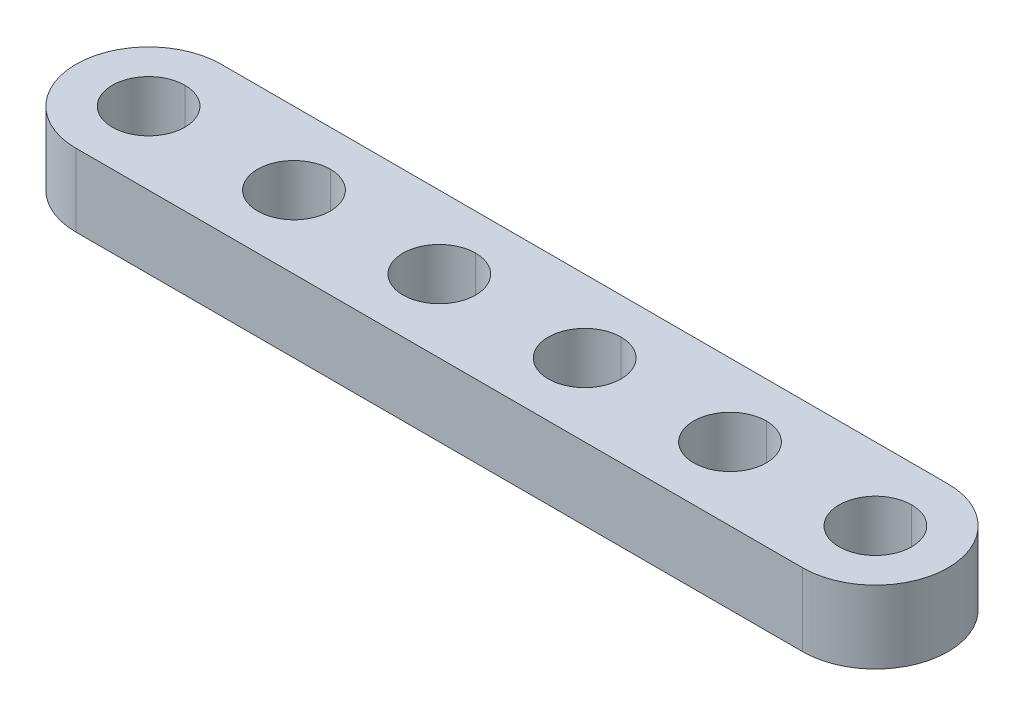
ISO-10303-21;
HEADER;
FILE_DESCRIPTION(('STEP AP214'),'2;1');
FILE_NAME('part.step','',(''),(''),'','','');
FILE_SCHEMA(('AUTOMOTIVE_DESIGN { 1 0 10303 214 1 1 1 1 }'));
ENDSEC;
DATA;
#1=APPLICATION_CONTEXT('core data for automotive mechanical design processes');
#2=APPLICATION_PROTOCOL_DEFINITION('international standard','automotive_design',2000,#1);
#3=PRODUCT_CONTEXT('',#1,'mechanical');
#4=PRODUCT('Part','Part','',(#3));
#5=PRODUCT_RELATED_PRODUCT_CATEGORY('part','',(#4));
#6=PRODUCT_DEFINITION_FORMATION('','',#4);
#7=PRODUCT_DEFINITION_CONTEXT('part definition',#1,'design');
#8=PRODUCT_DEFINITION('design','',#6,#7);
#9=PRODUCT_DEFINITION_SHAPE('','',#8);
#10=(LENGTH_UNIT() NAMED_UNIT(*) SI_UNIT(.MILLI.,.METRE.));
#11=(NAMED_UNIT(*) PLANE_ANGLE_UNIT() SI_UNIT($,.RADIAN.));
#12=(NAMED_UNIT(*) SI_UNIT($,.STERADIAN.) SOLID_ANGLE_UNIT());
#13=UNCERTAINTY_MEASURE_WITH_UNIT(LENGTH_MEASURE(1.E-05),#10,'distance_accuracy_value','');
#14=(GEOMETRIC_REPRESENTATION_CONTEXT(3) GLOBAL_UNCERTAINTY_ASSIGNED_CONTEXT((#13)) GLOBAL_UNIT_ASSIGNED_CONTEXT((#10,
#11,#12)) REPRESENTATION_CONTEXT('',''));
#15=CARTESIAN_POINT('',(0.,0.,0.));
#16=DIRECTION('',(0.,0.,1.));
#17=DIRECTION('',(1.,0.,0.));
#18=AXIS2_PLACEMENT_3D('',#15,#16,#17);
#19=CARTESIAN_POINT('',(20.,4.,0.));
#20=DIRECTION('',(0.,1.,0.));
#21=DIRECTION('',(0.,0.,1.));
#22=AXIS2_PLACEMENT_3D('',#19,#20,#21);
#23=CYLINDRICAL_SURFACE('',#22,2.);
#24=DIRECTION('',(0.,1.,0.));
#25=VECTOR('',#24,1.);
#26=CARTESIAN_POINT('',(20.,4.,-2.));
#27=LINE('',#26,#25);
#28=CARTESIAN_POINT('',(20.,0.,-2.));
#29=VERTEX_POINT('',#28);
#30=CARTESIAN_POINT('',(20.,4.,-2.));
#31=VERTEX_POINT('',#30);
#32=EDGE_CURVE('E253',#29,#31,#27,.T.);
#33=ORIENTED_EDGE('',*,*,#32,.F.);
#34=CARTESIAN_POINT('',(20.,0.,0.));
#35=DIRECTION('',(0.,1.,0.));
#36=DIRECTION('',(0.,0.,1.));
#37=AXIS2_PLACEMENT_3D('',#34,#35,#36);
#38=CIRCLE('',#37,2.);
#39=CARTESIAN_POINT('',(20.,0.,2.));
#40=VERTEX_POINT('',#39);
#41=EDGE_CURVE('E63',#40,#29,#38,.T.);
#42=ORIENTED_EDGE('',*,*,#41,.F.);
#43=DIRECTION('',(0.,1.,0.));
#44=VECTOR('',#43,1.);
#45=CARTESIAN_POINT('',(20.,4.,2.));
#46=LINE('',#45,#44);
#47=CARTESIAN_POINT('',(20.,4.,2.));
#48=VERTEX_POINT('',#47);
#49=EDGE_CURVE('E217',#40,#48,#46,.T.);
#50=ORIENTED_EDGE('',*,*,#49,.T.);
#51=CARTESIAN_POINT('',(20.,4.,0.));
#52=DIRECTION('',(0.,1.,0.));
#53=DIRECTION('',(0.,0.,1.));
#54=AXIS2_PLACEMENT_3D('',#51,#52,#53);
#55=CIRCLE('',#54,2.);
#56=EDGE_CURVE('E74',#48,#31,#55,.T.);
#57=ORIENTED_EDGE('',*,*,#56,.T.);
#58=EDGE_LOOP('',(#33,#42,#50,#57));
#59=FACE_BOUND('',#58,.T.);
#60=ADVANCED_FACE('F15',(#59),#23,.F.);
#61=CARTESIAN_POINT('',(12.,4.,0.));
#62=DIRECTION('',(0.,1.,0.));
#63=DIRECTION('',(0.,0.,1.));
#64=AXIS2_PLACEMENT_3D('',#61,#62,#63);
#65=CYLINDRICAL_SURFACE('',#64,2.);
#66=DIRECTION('',(0.,1.,0.));
#67=VECTOR('',#66,1.);
#68=CARTESIAN_POINT('',(12.,4.,-2.));
#69=LINE('',#68,#67);
#70=CARTESIAN_POINT('',(12.,0.,-2.));
#71=VERTEX_POINT('',#70);
#72=CARTESIAN_POINT('',(12.,4.,-2.));
#73=VERTEX_POINT('',#72);
#74=EDGE_CURVE('E216',#71,#73,#69,.T.);
#75=ORIENTED_EDGE('',*,*,#74,.F.);
#76=CARTESIAN_POINT('',(12.,0.,0.));
#77=DIRECTION('',(0.,1.,0.));
#78=DIRECTION('',(0.,0.,1.));
#79=AXIS2_PLACEMENT_3D('',#76,#77,#78);
#80=CIRCLE('',#79,2.);
#81=CARTESIAN_POINT('',(12.,0.,2.));
#82=VERTEX_POINT('',#81);
#83=EDGE_CURVE('E141',#82,#71,#80,.T.);
#84=ORIENTED_EDGE('',*,*,#83,.F.);
#85=DIRECTION('',(0.,1.,0.));
#86=VECTOR('',#85,1.);
#87=CARTESIAN_POINT('',(12.,4.,2.));
#88=LINE('',#87,#86);
#89=CARTESIAN_POINT('',(12.,4.,2.));
#90=VERTEX_POINT('',#89);
#91=EDGE_CURVE('E218',#82,#90,#88,.T.);
#92=ORIENTED_EDGE('',*,*,#91,.T.);
#93=CARTESIAN_POINT('',(12.,4.,0.));
#94=DIRECTION('',(0.,1.,0.));
#95=DIRECTION('',(0.,0.,1.));
#96=AXIS2_PLACEMENT_3D('',#93,#94,#95);
#97=CIRCLE('',#96,2.);
#98=EDGE_CURVE('E151',#90,#73,#97,.T.);
#99=ORIENTED_EDGE('',*,*,#98,.T.);
#100=EDGE_LOOP('',(#75,#84,#92,#99));
#101=FACE_BOUND('',#100,.T.);
#102=ADVANCED_FACE('F362',(#101),#65,.F.);
#103=CARTESIAN_POINT('',(4.,4.,0.));
#104=DIRECTION('',(0.,1.,0.));
#105=DIRECTION('',(0.,0.,1.));
#106=AXIS2_PLACEMENT_3D('',#103,#104,#105);
#107=CYLINDRICAL_SURFACE('',#106,2.);
#108=DIRECTION('',(0.,1.,0.));
#109=VECTOR('',#108,1.);
#110=CARTESIAN_POINT('',(4.,4.,-2.));
#111=LINE('',#110,#109);
#112=CARTESIAN_POINT('',(4.,0.,-2.));
#113=VERTEX_POINT('',#112);
#114=CARTESIAN_POINT('',(4.,4.,-2.));
#115=VERTEX_POINT('',#114);
#116=EDGE_CURVE('E226',#113,#115,#111,.T.);
#117=ORIENTED_EDGE('',*,*,#116,.F.);
#118=CARTESIAN_POINT('',(4.,0.,0.));
#119=DIRECTION('',(0.,1.,0.));
#120=DIRECTION('',(0.,0.,1.));
#121=AXIS2_PLACEMENT_3D('',#118,#119,#120);
#122=CIRCLE('',#121,2.);
#123=CARTESIAN_POINT('',(4.,0.,2.));
#124=VERTEX_POINT('',#123);
#125=EDGE_CURVE('E211',#124,#113,#122,.T.);
#126=ORIENTED_EDGE('',*,*,#125,.F.);
#127=DIRECTION('',(0.,1.,0.));
#128=VECTOR('',#127,1.);
#129=CARTESIAN_POINT('',(4.,4.,2.));
#130=LINE('',#129,#128);
#131=CARTESIAN_POINT('',(4.,4.,2.));
#132=VERTEX_POINT('',#131);
#133=EDGE_CURVE('E190',#124,#132,#130,.T.);
#134=ORIENTED_EDGE('',*,*,#133,.T.);
#135=CARTESIAN_POINT('',(4.,4.,0.));
#136=DIRECTION('',(0.,1.,0.));
#137=DIRECTION('',(0.,0.,1.));
#138=AXIS2_PLACEMENT_3D('',#135,#136,#137);
#139=CIRCLE('',#138,2.);
#140=EDGE_CURVE('E173',#132,#115,#139,.T.);
#141=ORIENTED_EDGE('',*,*,#140,.T.);
#142=EDGE_LOOP('',(#117,#126,#134,#141));
#143=FACE_BOUND('',#142,.T.);
#144=ADVANCED_FACE('F367',(#143),#107,.F.);
#145=CARTESIAN_POINT('',(-4.,4.,0.));
#146=DIRECTION('',(0.,1.,0.));
#147=DIRECTION('',(0.,0.,1.));
#148=AXIS2_PLACEMENT_3D('',#145,#146,#147);
#149=CYLINDRICAL_SURFACE('',#148,2.);
#150=DIRECTION('',(0.,1.,0.));
#151=VECTOR('',#150,1.);
#152=CARTESIAN_POINT('',(-4.,4.,-2.));
#153=LINE('',#152,#151);
#154=CARTESIAN_POINT('',(-4.,0.,-2.));
#155=VERTEX_POINT('',#154);
#156=CARTESIAN_POINT('',(-4.,4.,-2.));
#157=VERTEX_POINT('',#156);
#158=EDGE_CURVE('E165',#155,#157,#153,.T.);
#159=ORIENTED_EDGE('',*,*,#158,.F.);
#160=CARTESIAN_POINT('',(-4.,0.,0.));
#161=DIRECTION('',(0.,1.,0.));
#162=DIRECTION('',(0.,0.,1.));
#163=AXIS2_PLACEMENT_3D('',#160,#161,#162);
#164=CIRCLE('',#163,2.);
#165=CARTESIAN_POINT('',(-4.,0.,2.));
#166=VERTEX_POINT('',#165);
#167=EDGE_CURVE('E19',#166,#155,#164,.T.);
#168=ORIENTED_EDGE('',*,*,#167,.F.);
#169=DIRECTION('',(0.,1.,0.));
#170=VECTOR('',#169,1.);
#171=CARTESIAN_POINT('',(-4.,4.,2.));
#172=LINE('',#171,#170);
#173=CARTESIAN_POINT('',(-4.,4.,2.));
#174=VERTEX_POINT('',#173);
#175=EDGE_CURVE('E168',#166,#174,#172,.T.);
#176=ORIENTED_EDGE('',*,*,#175,.T.);
#177=CARTESIAN_POINT('',(-4.,4.,0.));
#178=DIRECTION('',(0.,1.,0.));
#179=DIRECTION('',(0.,0.,1.));
#180=AXIS2_PLACEMENT_3D('',#177,#178,#179);
#181=CIRCLE('',#180,2.);
#182=EDGE_CURVE('E161',#174,#157,#181,.T.);
#183=ORIENTED_EDGE('',*,*,#182,.T.);
#184=EDGE_LOOP('',(#159,#168,#176,#183));
#185=FACE_BOUND('',#184,.T.);
#186=ADVANCED_FACE('F163',(#185),#149,.F.);
#187=CARTESIAN_POINT('',(-12.,4.,0.));
#188=DIRECTION('',(0.,1.,0.));
#189=DIRECTION('',(0.,0.,1.));
#190=AXIS2_PLACEMENT_3D('',#187,#188,#189);
#191=CYLINDRICAL_SURFACE('',#190,2.);
#192=DIRECTION('',(0.,1.,0.));
#193=VECTOR('',#192,1.);
#194=CARTESIAN_POINT('',(-12.,4.,-2.));
#195=LINE('',#194,#193);
#196=CARTESIAN_POINT('',(-12.,0.,-2.));
#197=VERTEX_POINT('',#196);
#198=CARTESIAN_POINT('',(-12.,4.,-2.));
#199=VERTEX_POINT('',#198);
#200=EDGE_CURVE('E203',#197,#199,#195,.T.);
#201=ORIENTED_EDGE('',*,*,#200,.F.);
#202=CARTESIAN_POINT('',(-12.,0.,0.));
#203=DIRECTION('',(0.,1.,0.));
#204=DIRECTION('',(0.,0.,1.));
#205=AXIS2_PLACEMENT_3D('',#202,#203,#204);
#206=CIRCLE('',#205,2.);
#207=CARTESIAN_POINT('',(-12.,0.,2.));
#208=VERTEX_POINT('',#207);
#209=EDGE_CURVE('E26',#208,#197,#206,.T.);
#210=ORIENTED_EDGE('',*,*,#209,.F.);
#211=DIRECTION('',(0.,1.,0.));
#212=VECTOR('',#211,1.);
#213=CARTESIAN_POINT('',(-12.,4.,2.));
#214=LINE('',#213,#212);
#215=CARTESIAN_POINT('',(-12.,4.,2.));
#216=VERTEX_POINT('',#215);
#217=EDGE_CURVE('E287',#208,#216,#214,.T.);
#218=ORIENTED_EDGE('',*,*,#217,.T.);
#219=CARTESIAN_POINT('',(-12.,4.,0.));
#220=DIRECTION('',(0.,1.,0.));
#221=DIRECTION('',(0.,0.,1.));
#222=AXIS2_PLACEMENT_3D('',#219,#220,#221);
#223=CIRCLE('',#222,2.);
#224=EDGE_CURVE('E172',#216,#199,#223,.T.);
#225=ORIENTED_EDGE('',*,*,#224,.T.);
#226=EDGE_LOOP('',(#201,#210,#218,#225));
#227=FACE_BOUND('',#226,.T.);
#228=ADVANCED_FACE('F397',(#227),#191,.F.);
#229=CARTESIAN_POINT('',(-20.,4.,0.));
#230=DIRECTION('',(0.,1.,0.));
#231=DIRECTION('',(0.,0.,1.));
#232=AXIS2_PLACEMENT_3D('',#229,#230,#231);
#233=CYLINDRICAL_SURFACE('',#232,2.);
#234=DIRECTION('',(0.,1.,0.));
#235=VECTOR('',#234,1.);
#236=CARTESIAN_POINT('',(-20.,4.,-2.));
#237=LINE('',#236,#235);
#238=CARTESIAN_POINT('',(-20.,0.,-2.));
#239=VERTEX_POINT('',#238);
#240=CARTESIAN_POINT('',(-20.,4.,-2.));
#241=VERTEX_POINT('',#240);
#242=EDGE_CURVE('E248',#239,#241,#237,.T.);
#243=ORIENTED_EDGE('',*,*,#242,.F.);
#244=CARTESIAN_POINT('',(-20.,0.,0.));
#245=DIRECTION('',(0.,1.,0.));
#246=DIRECTION('',(0.,0.,1.));
#247=AXIS2_PLACEMENT_3D('',#244,#245,#246);
#248=CIRCLE('',#247,2.);
#249=CARTESIAN_POINT('',(-20.,0.,2.));
#250=VERTEX_POINT('',#249);
#251=EDGE_CURVE('E10',#250,#239,#248,.T.);
#252=ORIENTED_EDGE('',*,*,#251,.F.);
#253=DIRECTION('',(0.,1.,0.));
#254=VECTOR('',#253,1.);
#255=CARTESIAN_POINT('',(-20.,4.,2.));
#256=LINE('',#255,#254);
#257=CARTESIAN_POINT('',(-20.,4.,2.));
#258=VERTEX_POINT('',#257);
#259=EDGE_CURVE('E232',#250,#258,#256,.T.);
#260=ORIENTED_EDGE('',*,*,#259,.T.);
#261=CARTESIAN_POINT('',(-20.,4.,0.));
#262=DIRECTION('',(0.,1.,0.));
#263=DIRECTION('',(0.,0.,1.));
#264=AXIS2_PLACEMENT_3D('',#261,#262,#263);
#265=CIRCLE('',#264,2.);
#266=EDGE_CURVE('E267',#258,#241,#265,.T.);
#267=ORIENTED_EDGE('',*,*,#266,.T.);
#268=EDGE_LOOP('',(#243,#252,#260,#267));
#269=FACE_BOUND('',#268,.T.);
#270=ADVANCED_FACE('F392',(#269),#233,.F.);
#271=CARTESIAN_POINT('',(-20.,0.,0.));
#272=DIRECTION('',(0.,1.,0.));
#273=DIRECTION('',(1.,0.,0.));
#274=AXIS2_PLACEMENT_3D('',#271,#272,#273);
#275=PLANE('',#274);
#276=ORIENTED_EDGE('',*,*,#251,.T.);
#277=CARTESIAN_POINT('',(-20.,0.,0.));
#278=DIRECTION('',(0.,1.,0.));
#279=DIRECTION('',(0.,0.,1.));
#280=AXIS2_PLACEMENT_3D('',#277,#278,#279);
#281=CIRCLE('',#280,2.);
#282=EDGE_CURVE('E260',#239,#250,#281,.T.);
#283=ORIENTED_EDGE('',*,*,#282,.T.);
#284=EDGE_LOOP('',(#276,#283));
#285=FACE_BOUND('',#284,.T.);
#286=ORIENTED_EDGE('',*,*,#209,.T.);
#287=CARTESIAN_POINT('',(-12.,0.,0.));
#288=DIRECTION('',(0.,1.,0.));
#289=DIRECTION('',(0.,0.,1.));
#290=AXIS2_PLACEMENT_3D('',#287,#288,#289);
#291=CIRCLE('',#290,2.);
#292=EDGE_CURVE('E208',#197,#208,#291,.T.);
#293=ORIENTED_EDGE('',*,*,#292,.T.);
#294=EDGE_LOOP('',(#286,#293));
#295=FACE_BOUND('',#294,.T.);
#296=ORIENTED_EDGE('',*,*,#167,.T.);
#297=CARTESIAN_POINT('',(-4.,0.,0.));
#298=DIRECTION('',(0.,1.,0.));
#299=DIRECTION('',(0.,0.,1.));
#300=AXIS2_PLACEMENT_3D('',#297,#298,#299);
#301=CIRCLE('',#300,2.);
#302=EDGE_CURVE('E182',#155,#166,#301,.T.);
#303=ORIENTED_EDGE('',*,*,#302,.T.);
#304=EDGE_LOOP('',(#296,#303));
#305=FACE_BOUND('',#304,.T.);
#306=ORIENTED_EDGE('',*,*,#125,.T.);
#307=CARTESIAN_POINT('',(4.,0.,0.));
#308=DIRECTION('',(0.,1.,0.));
#309=DIRECTION('',(0.,0.,1.));
#310=AXIS2_PLACEMENT_3D('',#307,#308,#309);
#311=CIRCLE('',#310,2.);
#312=EDGE_CURVE('E221',#113,#124,#311,.T.);
#313=ORIENTED_EDGE('',*,*,#312,.T.);
#314=EDGE_LOOP('',(#306,#313));
#315=FACE_BOUND('',#314,.T.);
#316=ORIENTED_EDGE('',*,*,#83,.T.);
#317=CARTESIAN_POINT('',(12.,0.,0.));
#318=DIRECTION('',(0.,1.,0.));
#319=DIRECTION('',(0.,0.,1.));
#320=AXIS2_PLACEMENT_3D('',#317,#318,#319);
#321=CIRCLE('',#320,2.);
#322=EDGE_CURVE('E212',#71,#82,#321,.T.);
#323=ORIENTED_EDGE('',*,*,#322,.T.);
#324=EDGE_LOOP('',(#316,#323));
#325=FACE_BOUND('',#324,.T.);
#326=ORIENTED_EDGE('',*,*,#41,.T.);
#327=CARTESIAN_POINT('',(20.,0.,0.));
#328=DIRECTION('',(0.,1.,0.));
#329=DIRECTION('',(0.,0.,1.));
#330=AXIS2_PLACEMENT_3D('',#327,#328,#329);
#331=CIRCLE('',#330,2.);
#332=EDGE_CURVE('E301',#29,#40,#331,.T.);
#333=ORIENTED_EDGE('',*,*,#332,.T.);
#334=EDGE_LOOP('',(#326,#333));
#335=FACE_BOUND('',#334,.T.);
#336=CARTESIAN_POINT('',(-20.,0.,0.));
#337=DIRECTION('',(0.,1.,0.));
#338=DIRECTION('',(0.,0.,1.));
#339=AXIS2_PLACEMENT_3D('',#336,#337,#338);
#340=CIRCLE('',#339,4.);
#341=CARTESIAN_POINT('',(-20.,0.,-4.));
#342=VERTEX_POINT('',#341);
#343=CARTESIAN_POINT('',(-20.,0.,4.));
#344=VERTEX_POINT('',#343);
#345=EDGE_CURVE('E227',#342,#344,#340,.T.);
#346=ORIENTED_EDGE('',*,*,#345,.F.);
#347=DIRECTION('',(-1.,0.,0.));
#348=VECTOR('',#347,1.);
#349=CARTESIAN_POINT('',(-20.,0.,-4.));
#350=LINE('',#349,#348);
#351=CARTESIAN_POINT('',(20.,0.,-4.));
#352=VERTEX_POINT('',#351);
#353=EDGE_CURVE('E280',#352,#342,#350,.T.);
#354=ORIENTED_EDGE('',*,*,#353,.F.);
#355=CARTESIAN_POINT('',(20.,0.,0.));
#356=DIRECTION('',(0.,1.,0.));
#357=DIRECTION('',(0.,0.,1.));
#358=AXIS2_PLACEMENT_3D('',#355,#356,#357);
#359=CIRCLE('',#358,4.);
#360=CARTESIAN_POINT('',(20.,0.,4.));
#361=VERTEX_POINT('',#360);
#362=EDGE_CURVE('E201',#361,#352,#359,.T.);
#363=ORIENTED_EDGE('',*,*,#362,.F.);
#364=DIRECTION('',(1.,0.,0.));
#365=VECTOR('',#364,1.);
#366=CARTESIAN_POINT('',(-20.,0.,4.));
#367=LINE('',#366,#365);
#368=EDGE_CURVE('E243',#344,#361,#367,.T.);
#369=ORIENTED_EDGE('',*,*,#368,.F.);
#370=EDGE_LOOP('',(#346,#354,#363,#369));
#371=FACE_BOUND('',#370,.T.);
#372=ADVANCED_FACE('F345',(#285,#295,#305,#315,#325,#335,#371),#275,.F.);
#373=CARTESIAN_POINT('',(-20.,4.,0.));
#374=DIRECTION('',(0.,1.,0.));
#375=DIRECTION('',(1.,0.,0.));
#376=AXIS2_PLACEMENT_3D('',#373,#374,#375);
#377=PLANE('',#376);
#378=ORIENTED_EDGE('',*,*,#266,.F.);
#379=CARTESIAN_POINT('',(-20.,4.,0.));
#380=DIRECTION('',(0.,1.,0.));
#381=DIRECTION('',(0.,0.,1.));
#382=AXIS2_PLACEMENT_3D('',#379,#380,#381);
#383=CIRCLE('',#382,2.);
#384=EDGE_CURVE('E238',#241,#258,#383,.T.);
#385=ORIENTED_EDGE('',*,*,#384,.F.);
#386=EDGE_LOOP('',(#378,#385));
#387=FACE_BOUND('',#386,.T.);
#388=ORIENTED_EDGE('',*,*,#224,.F.);
#389=CARTESIAN_POINT('',(-12.,4.,0.));
#390=DIRECTION('',(0.,1.,0.));
#391=DIRECTION('',(0.,0.,1.));
#392=AXIS2_PLACEMENT_3D('',#389,#390,#391);
#393=CIRCLE('',#392,2.);
#394=EDGE_CURVE('E207',#199,#216,#393,.T.);
#395=ORIENTED_EDGE('',*,*,#394,.F.);
#396=EDGE_LOOP('',(#388,#395));
#397=FACE_BOUND('',#396,.T.);
#398=ORIENTED_EDGE('',*,*,#182,.F.);
#399=CARTESIAN_POINT('',(-4.,4.,0.));
#400=DIRECTION('',(0.,1.,0.));
#401=DIRECTION('',(0.,0.,1.));
#402=AXIS2_PLACEMENT_3D('',#399,#400,#401);
#403=CIRCLE('',#402,2.);
#404=EDGE_CURVE('E175',#157,#174,#403,.T.);
#405=ORIENTED_EDGE('',*,*,#404,.F.);
#406=EDGE_LOOP('',(#398,#405));
#407=FACE_BOUND('',#406,.T.);
#408=ORIENTED_EDGE('',*,*,#140,.F.);
#409=CARTESIAN_POINT('',(4.,4.,0.));
#410=DIRECTION('',(0.,1.,0.));
#411=DIRECTION('',(0.,0.,1.));
#412=AXIS2_PLACEMENT_3D('',#409,#410,#411);
#413=CIRCLE('',#412,2.);
#414=EDGE_CURVE('E194',#115,#132,#413,.T.);
#415=ORIENTED_EDGE('',*,*,#414,.F.);
#416=EDGE_LOOP('',(#408,#415));
#417=FACE_BOUND('',#416,.T.);
#418=ORIENTED_EDGE('',*,*,#98,.F.);
#419=CARTESIAN_POINT('',(12.,4.,0.));
#420=DIRECTION('',(0.,1.,0.));
#421=DIRECTION('',(0.,0.,1.));
#422=AXIS2_PLACEMENT_3D('',#419,#420,#421);
#423=CIRCLE('',#422,2.);
#424=EDGE_CURVE('E222',#73,#90,#423,.T.);
#425=ORIENTED_EDGE('',*,*,#424,.F.);
#426=EDGE_LOOP('',(#418,#425));
#427=FACE_BOUND('',#426,.T.);
#428=ORIENTED_EDGE('',*,*,#56,.F.);
#429=CARTESIAN_POINT('',(20.,4.,0.));
#430=DIRECTION('',(0.,1.,0.));
#431=DIRECTION('',(0.,0.,1.));
#432=AXIS2_PLACEMENT_3D('',#429,#430,#431);
#433=CIRCLE('',#432,2.);
#434=EDGE_CURVE('E249',#31,#48,#433,.T.);
#435=ORIENTED_EDGE('',*,*,#434,.F.);
#436=EDGE_LOOP('',(#428,#435));
#437=FACE_BOUND('',#436,.T.);
#438=CARTESIAN_POINT('',(-20.,4.,0.));
#439=DIRECTION('',(0.,1.,0.));
#440=DIRECTION('',(0.,0.,1.));
#441=AXIS2_PLACEMENT_3D('',#438,#439,#440);
#442=CIRCLE('',#441,4.);
#443=CARTESIAN_POINT('',(-20.,4.,-4.));
#444=VERTEX_POINT('',#443);
#445=CARTESIAN_POINT('',(-20.,4.,4.));
#446=VERTEX_POINT('',#445);
#447=EDGE_CURVE('E244',#444,#446,#442,.T.);
#448=ORIENTED_EDGE('',*,*,#447,.T.);
#449=DIRECTION('',(1.,0.,0.));
#450=VECTOR('',#449,1.);
#451=CARTESIAN_POINT('',(-20.,4.,4.));
#452=LINE('',#451,#450);
#453=CARTESIAN_POINT('',(20.,4.,4.));
#454=VERTEX_POINT('',#453);
#455=EDGE_CURVE('E197',#446,#454,#452,.T.);
#456=ORIENTED_EDGE('',*,*,#455,.T.);
#457=CARTESIAN_POINT('',(20.,4.,0.));
#458=DIRECTION('',(0.,1.,0.));
#459=DIRECTION('',(0.,0.,1.));
#460=AXIS2_PLACEMENT_3D('',#457,#458,#459);
#461=CIRCLE('',#460,4.);
#462=CARTESIAN_POINT('',(20.,4.,-4.));
#463=VERTEX_POINT('',#462);
#464=EDGE_CURVE('E277',#454,#463,#461,.T.);
#465=ORIENTED_EDGE('',*,*,#464,.T.);
#466=DIRECTION('',(-1.,0.,0.));
#467=VECTOR('',#466,1.);
#468=CARTESIAN_POINT('',(-20.,4.,-4.));
#469=LINE('',#468,#467);
#470=EDGE_CURVE('E41',#463,#444,#469,.T.);
#471=ORIENTED_EDGE('',*,*,#470,.T.);
#472=EDGE_LOOP('',(#448,#456,#465,#471));
#473=FACE_BOUND('',#472,.T.);
#474=ADVANCED_FACE('F176',(#387,#397,#407,#417,#427,#437,#473),#377,.T.);
#475=CARTESIAN_POINT('',(-20.,4.,-4.));
#476=DIRECTION('',(0.,0.,1.));
#477=DIRECTION('',(1.,0.,0.));
#478=AXIS2_PLACEMENT_3D('',#475,#476,#477);
#479=PLANE('',#478);
#480=ORIENTED_EDGE('',*,*,#353,.T.);
#481=DIRECTION('',(0.,-1.,0.));
#482=VECTOR('',#481,1.);
#483=CARTESIAN_POINT('',(-20.,4.,-4.));
#484=LINE('',#483,#482);
#485=EDGE_CURVE('E239',#444,#342,#484,.T.);
#486=ORIENTED_EDGE('',*,*,#485,.F.);
#487=ORIENTED_EDGE('',*,*,#470,.F.);
#488=DIRECTION('',(0.,-1.,0.));
#489=VECTOR('',#488,1.);
#490=CARTESIAN_POINT('',(20.,4.,-4.));
#491=LINE('',#490,#489);
#492=EDGE_CURVE('E281',#463,#352,#491,.T.);
#493=ORIENTED_EDGE('',*,*,#492,.T.);
#494=EDGE_LOOP('',(#480,#486,#487,#493));
#495=FACE_BOUND('',#494,.T.);
#496=ADVANCED_FACE('F347',(#495),#479,.F.);
#497=CARTESIAN_POINT('',(20.,4.,0.));
#498=DIRECTION('',(0.,-1.,0.));
#499=DIRECTION('',(0.,0.,-1.));
#500=AXIS2_PLACEMENT_3D('',#497,#498,#499);
#501=CYLINDRICAL_SURFACE('',#500,4.);
#502=ORIENTED_EDGE('',*,*,#362,.T.);
#503=ORIENTED_EDGE('',*,*,#492,.F.);
#504=ORIENTED_EDGE('',*,*,#464,.F.);
#505=DIRECTION('',(0.,-1.,0.));
#506=VECTOR('',#505,1.);
#507=CARTESIAN_POINT('',(20.,4.,4.));
#508=LINE('',#507,#506);
#509=EDGE_CURVE('E202',#454,#361,#508,.T.);
#510=ORIENTED_EDGE('',*,*,#509,.T.);
#511=EDGE_LOOP('',(#502,#503,#504,#510));
#512=FACE_BOUND('',#511,.T.);
#513=ADVANCED_FACE('F339',(#512),#501,.T.);
#514=CARTESIAN_POINT('',(-20.,4.,4.));
#515=DIRECTION('',(0.,0.,-1.));
#516=DIRECTION('',(0.,-1.,0.));
#517=AXIS2_PLACEMENT_3D('',#514,#515,#516);
#518=PLANE('',#517);
#519=ORIENTED_EDGE('',*,*,#368,.T.);
#520=ORIENTED_EDGE('',*,*,#509,.F.);
#521=ORIENTED_EDGE('',*,*,#455,.F.);
#522=DIRECTION('',(0.,-1.,0.));
#523=VECTOR('',#522,1.);
#524=CARTESIAN_POINT('',(-20.,4.,4.));
#525=LINE('',#524,#523);
#526=EDGE_CURVE('E231',#446,#344,#525,.T.);
#527=ORIENTED_EDGE('',*,*,#526,.T.);
#528=EDGE_LOOP('',(#519,#520,#521,#527));
#529=FACE_BOUND('',#528,.T.);
#530=ADVANCED_FACE('F355',(#529),#518,.F.);
#531=CARTESIAN_POINT('',(-20.,4.,0.));
#532=DIRECTION('',(0.,-1.,0.));
#533=DIRECTION('',(0.,0.,-1.));
#534=AXIS2_PLACEMENT_3D('',#531,#532,#533);
#535=CYLINDRICAL_SURFACE('',#534,4.);
#536=ORIENTED_EDGE('',*,*,#345,.T.);
#537=ORIENTED_EDGE('',*,*,#526,.F.);
#538=ORIENTED_EDGE('',*,*,#447,.F.);
#539=ORIENTED_EDGE('',*,*,#485,.T.);
#540=EDGE_LOOP('',(#536,#537,#538,#539));
#541=FACE_BOUND('',#540,.T.);
#542=ADVANCED_FACE('F378',(#541),#535,.T.);
#543=CARTESIAN_POINT('',(-20.,4.,0.));
#544=DIRECTION('',(0.,1.,0.));
#545=DIRECTION('',(0.,0.,1.));
#546=AXIS2_PLACEMENT_3D('',#543,#544,#545);
#547=CYLINDRICAL_SURFACE('',#546,2.);
#548=ORIENTED_EDGE('',*,*,#282,.F.);
#549=ORIENTED_EDGE('',*,*,#242,.T.);
#550=ORIENTED_EDGE('',*,*,#384,.T.);
#551=ORIENTED_EDGE('',*,*,#259,.F.);
#552=EDGE_LOOP('',(#548,#549,#550,#551));
#553=FACE_BOUND('',#552,.T.);
#554=ADVANCED_FACE('F17',(#553),#547,.F.);
#555=CARTESIAN_POINT('',(-12.,4.,0.));
#556=DIRECTION('',(0.,1.,0.));
#557=DIRECTION('',(0.,0.,1.));
#558=AXIS2_PLACEMENT_3D('',#555,#556,#557);
#559=CYLINDRICAL_SURFACE('',#558,2.);
#560=ORIENTED_EDGE('',*,*,#292,.F.);
#561=ORIENTED_EDGE('',*,*,#200,.T.);
#562=ORIENTED_EDGE('',*,*,#394,.T.);
#563=ORIENTED_EDGE('',*,*,#217,.F.);
#564=EDGE_LOOP('',(#560,#561,#562,#563));
#565=FACE_BOUND('',#564,.T.);
#566=ADVANCED_FACE('F383',(#565),#559,.F.);
#567=CARTESIAN_POINT('',(-4.,4.,0.));
#568=DIRECTION('',(0.,1.,0.));
#569=DIRECTION('',(0.,0.,1.));
#570=AXIS2_PLACEMENT_3D('',#567,#568,#569);
#571=CYLINDRICAL_SURFACE('',#570,2.);
#572=ORIENTED_EDGE('',*,*,#302,.F.);
#573=ORIENTED_EDGE('',*,*,#158,.T.);
#574=ORIENTED_EDGE('',*,*,#404,.T.);
#575=ORIENTED_EDGE('',*,*,#175,.F.);
#576=EDGE_LOOP('',(#572,#573,#574,#575));
#577=FACE_BOUND('',#576,.T.);
#578=ADVANCED_FACE('F180',(#577),#571,.F.);
#579=CARTESIAN_POINT('',(4.,4.,0.));
#580=DIRECTION('',(0.,1.,0.));
#581=DIRECTION('',(0.,0.,1.));
#582=AXIS2_PLACEMENT_3D('',#579,#580,#581);
#583=CYLINDRICAL_SURFACE('',#582,2.);
#584=ORIENTED_EDGE('',*,*,#312,.F.);
#585=ORIENTED_EDGE('',*,*,#116,.T.);
#586=ORIENTED_EDGE('',*,*,#414,.T.);
#587=ORIENTED_EDGE('',*,*,#133,.F.);
#588=EDGE_LOOP('',(#584,#585,#586,#587));
#589=FACE_BOUND('',#588,.T.);
#590=ADVANCED_FACE('F371',(#589),#583,.F.);
#591=CARTESIAN_POINT('',(12.,4.,0.));
#592=DIRECTION('',(0.,1.,0.));
#593=DIRECTION('',(0.,0.,1.));
#594=AXIS2_PLACEMENT_3D('',#591,#592,#593);
#595=CYLINDRICAL_SURFACE('',#594,2.);
#596=ORIENTED_EDGE('',*,*,#322,.F.);
#597=ORIENTED_EDGE('',*,*,#74,.T.);
#598=ORIENTED_EDGE('',*,*,#424,.T.);
#599=ORIENTED_EDGE('',*,*,#91,.F.);
#600=EDGE_LOOP('',(#596,#597,#598,#599));
#601=FACE_BOUND('',#600,.T.);
#602=ADVANCED_FACE('F374',(#601),#595,.F.);
#603=CARTESIAN_POINT('',(20.,4.,0.));
#604=DIRECTION('',(0.,1.,0.));
#605=DIRECTION('',(0.,0.,1.));
#606=AXIS2_PLACEMENT_3D('',#603,#604,#605);
#607=CYLINDRICAL_SURFACE('',#606,2.);
#608=ORIENTED_EDGE('',*,*,#332,.F.);
#609=ORIENTED_EDGE('',*,*,#32,.T.);
#610=ORIENTED_EDGE('',*,*,#434,.T.);
#611=ORIENTED_EDGE('',*,*,#49,.F.);
#612=EDGE_LOOP('',(#608,#609,#610,#611));
#613=FACE_BOUND('',#612,.T.);
#614=ADVANCED_FACE('F389',(#613),#607,.F.);
#615=CLOSED_SHELL('',(#60,#102,#144,#186,#228,#270,#372,#474,#496,#513,#530,#542,#554,#566,#578,
#590,#602,#614));
#616=MANIFOLD_SOLID_BREP('B1',#615);
#617=ADVANCED_BREP_SHAPE_REPRESENTATION('',(#18,#616),#14);
#618=SHAPE_DEFINITION_REPRESENTATION(#9,#617);
ENDSEC;
END-ISO-10303-21;
